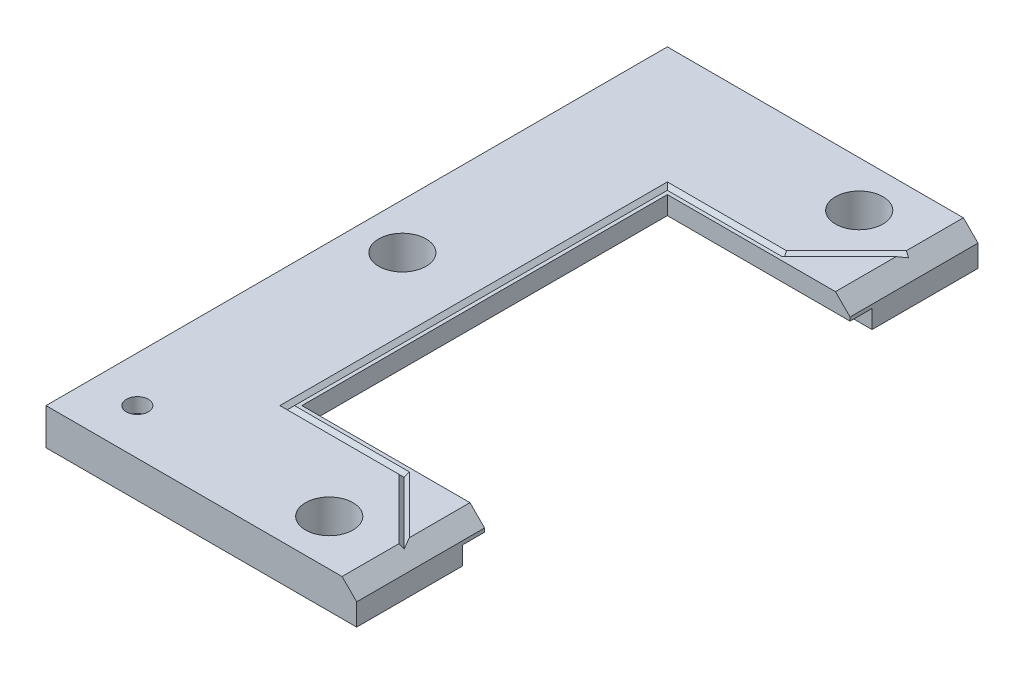
ISO-10303-21;
HEADER;
FILE_DESCRIPTION(('STEP AP214'),'2;1');
FILE_NAME('part.step','',(''),(''),'','','');
FILE_SCHEMA(('AUTOMOTIVE_DESIGN { 1 0 10303 214 1 1 1 1 }'));
ENDSEC;
DATA;
#1=APPLICATION_CONTEXT('core data for automotive mechanical design processes');
#2=APPLICATION_PROTOCOL_DEFINITION('international standard','automotive_design',2000,#1);
#3=PRODUCT_CONTEXT('',#1,'mechanical');
#4=PRODUCT('Part','Part','',(#3));
#5=PRODUCT_RELATED_PRODUCT_CATEGORY('part','',(#4));
#6=PRODUCT_DEFINITION_FORMATION('','',#4);
#7=PRODUCT_DEFINITION_CONTEXT('part definition',#1,'design');
#8=PRODUCT_DEFINITION('design','',#6,#7);
#9=PRODUCT_DEFINITION_SHAPE('','',#8);
#10=(LENGTH_UNIT() NAMED_UNIT(*) SI_UNIT(.MILLI.,.METRE.));
#11=(NAMED_UNIT(*) PLANE_ANGLE_UNIT() SI_UNIT($,.RADIAN.));
#12=(NAMED_UNIT(*) SI_UNIT($,.STERADIAN.) SOLID_ANGLE_UNIT());
#13=UNCERTAINTY_MEASURE_WITH_UNIT(LENGTH_MEASURE(1.E-05),#10,'distance_accuracy_value','');
#14=(GEOMETRIC_REPRESENTATION_CONTEXT(3) GLOBAL_UNCERTAINTY_ASSIGNED_CONTEXT((#13)) GLOBAL_UNIT_ASSIGNED_CONTEXT((#10,
#11,#12)) REPRESENTATION_CONTEXT('',''));
#15=CARTESIAN_POINT('',(0.,0.,0.));
#16=DIRECTION('',(0.,0.,1.));
#17=DIRECTION('',(1.,0.,0.));
#18=AXIS2_PLACEMENT_3D('',#15,#16,#17);
#19=CARTESIAN_POINT('',(0.,10.,0.));
#20=DIRECTION('',(0.,-1.,0.));
#21=DIRECTION('',(0.,0.,-1.));
#22=AXIS2_PLACEMENT_3D('',#19,#20,#21);
#23=PLANE('',#22);
#24=CARTESIAN_POINT('',(-19.9999999999997,10.,-72.5000000000001));
#25=DIRECTION('',(0.,1.,0.));
#26=DIRECTION('',(-1.,0.,0.));
#27=AXIS2_PLACEMENT_3D('',#24,#25,#26);
#28=CIRCLE('',#27,6.50000000000002);
#29=CARTESIAN_POINT('',(-26.4999999999997,10.,-72.5000000000001));
#30=VERTEX_POINT('',#29);
#31=EDGE_CURVE('E275',#30,#30,#28,.T.);
#32=ORIENTED_EDGE('',*,*,#31,.F.);
#33=EDGE_LOOP('',(#32));
#34=FACE_BOUND('',#33,.T.);
#35=CARTESIAN_POINT('',(-19.9999999999998,10.,72.4999999999999));
#36=DIRECTION('',(0.,1.,0.));
#37=DIRECTION('',(-1.,0.,0.));
#38=AXIS2_PLACEMENT_3D('',#35,#36,#37);
#39=CIRCLE('',#38,6.50000000000002);
#40=CARTESIAN_POINT('',(-26.4999999999998,10.,72.4999999999999));
#41=VERTEX_POINT('',#40);
#42=EDGE_CURVE('E286',#41,#41,#39,.T.);
#43=ORIENTED_EDGE('',*,*,#42,.F.);
#44=EDGE_LOOP('',(#43));
#45=FACE_BOUND('',#44,.T.);
#46=CARTESIAN_POINT('',(-72.4999600306071,10.,-1.59935215800008E-13));
#47=DIRECTION('',(0.,1.,0.));
#48=DIRECTION('',(-1.,0.,0.));
#49=AXIS2_PLACEMENT_3D('',#46,#47,#48);
#50=CIRCLE('',#49,6.50000000000002);
#51=CARTESIAN_POINT('',(-78.9999600306071,10.,-1.59935215800008E-13));
#52=VERTEX_POINT('',#51);
#53=EDGE_CURVE('E280',#52,#52,#50,.T.);
#54=ORIENTED_EDGE('',*,*,#53,.F.);
#55=EDGE_LOOP('',(#54));
#56=FACE_BOUND('',#55,.T.);
#57=CARTESIAN_POINT('',(-72.4999999999998,10.,72.4999999999999));
#58=DIRECTION('',(0.,1.,0.));
#59=DIRECTION('',(0.,0.,1.));
#60=AXIS2_PLACEMENT_3D('',#57,#58,#59);
#61=CIRCLE('',#60,3.);
#62=CARTESIAN_POINT('',(-72.4999999999998,10.,75.4999999999999));
#63=VERTEX_POINT('',#62);
#64=EDGE_CURVE('E269',#63,#63,#61,.T.);
#65=ORIENTED_EDGE('',*,*,#64,.F.);
#66=EDGE_LOOP('',(#65));
#67=FACE_BOUND('',#66,.T.);
#68=DIRECTION('',(0.707106781186551,0.,-0.707106781186544));
#69=VECTOR('',#68,1.);
#70=CARTESIAN_POINT('',(-21.1000000000002,10.,-52.3142135623732));
#71=LINE('',#70,#69);
#72=CARTESIAN_POINT('',(-20.4142135623734,10.,-53.));
#73=VERTEX_POINT('',#72);
#74=CARTESIAN_POINT('',(-4.,10.,-69.4142135623732));
#75=VERTEX_POINT('',#74);
#76=EDGE_CURVE('E263',#73,#75,#71,.T.);
#77=ORIENTED_EDGE('',*,*,#76,.T.);
#78=DIRECTION('',(0.,0.,-1.));
#79=VECTOR('',#78,1.);
#80=CARTESIAN_POINT('',(-4.,10.,0.));
#81=LINE('',#80,#79);
#82=CARTESIAN_POINT('',(-3.99999999999999,10.,-85.));
#83=VERTEX_POINT('',#82);
#84=EDGE_CURVE('E390',#75,#83,#81,.T.);
#85=ORIENTED_EDGE('',*,*,#84,.T.);
#86=DIRECTION('',(-1.,0.,0.));
#87=VECTOR('',#86,1.);
#88=CARTESIAN_POINT('',(-85.,10.,-85.));
#89=LINE('',#88,#87);
#90=CARTESIAN_POINT('',(-85.,10.,-85.));
#91=VERTEX_POINT('',#90);
#92=EDGE_CURVE('E356',#83,#91,#89,.T.);
#93=ORIENTED_EDGE('',*,*,#92,.T.);
#94=DIRECTION('',(0.,0.,1.));
#95=VECTOR('',#94,1.);
#96=CARTESIAN_POINT('',(-85.,10.,85.));
#97=LINE('',#96,#95);
#98=CARTESIAN_POINT('',(-85.,10.,85.));
#99=VERTEX_POINT('',#98);
#100=EDGE_CURVE('E342',#91,#99,#97,.T.);
#101=ORIENTED_EDGE('',*,*,#100,.T.);
#102=DIRECTION('',(1.,0.,0.));
#103=VECTOR('',#102,1.);
#104=CARTESIAN_POINT('',(-85.,10.,85.));
#105=LINE('',#104,#103);
#106=CARTESIAN_POINT('',(-4.00000000000005,10.,85.));
#107=VERTEX_POINT('',#106);
#108=EDGE_CURVE('E345',#99,#107,#105,.T.);
#109=ORIENTED_EDGE('',*,*,#108,.T.);
#110=DIRECTION('',(0.,0.,-1.));
#111=VECTOR('',#110,1.);
#112=CARTESIAN_POINT('',(-4.00000000000003,10.,0.));
#113=LINE('',#112,#111);
#114=CARTESIAN_POINT('',(-4.00000000000004,10.,69.4142135623731));
#115=VERTEX_POINT('',#114);
#116=EDGE_CURVE('E395',#107,#115,#113,.T.);
#117=ORIENTED_EDGE('',*,*,#116,.T.);
#118=DIRECTION('',(-0.707106781186551,0.,-0.707106781186544));
#119=VECTOR('',#118,1.);
#120=CARTESIAN_POINT('',(-0.707106781186559,10.,72.7071067811866));
#121=LINE('',#120,#119);
#122=CARTESIAN_POINT('',(-20.4142135623733,10.,53.));
#123=VERTEX_POINT('',#122);
#124=EDGE_CURVE('E206',#115,#123,#121,.T.);
#125=ORIENTED_EDGE('',*,*,#124,.T.);
#126=DIRECTION('',(-1.,0.,0.));
#127=VECTOR('',#126,1.);
#128=CARTESIAN_POINT('',(-19.4443650813899,10.,53.));
#129=LINE('',#128,#127);
#130=CARTESIAN_POINT('',(-53.,10.,53.));
#131=VERTEX_POINT('',#130);
#132=EDGE_CURVE('E225',#123,#131,#129,.T.);
#133=ORIENTED_EDGE('',*,*,#132,.T.);
#134=DIRECTION('',(0.,0.,-1.));
#135=VECTOR('',#134,1.);
#136=CARTESIAN_POINT('',(-53.,10.,53.2));
#137=LINE('',#136,#135);
#138=CARTESIAN_POINT('',(-53.,10.,-53.));
#139=VERTEX_POINT('',#138);
#140=EDGE_CURVE('E239',#131,#139,#137,.T.);
#141=ORIENTED_EDGE('',*,*,#140,.T.);
#142=DIRECTION('',(1.,0.,0.));
#143=VECTOR('',#142,1.);
#144=CARTESIAN_POINT('',(-53.2,10.,-53.));
#145=LINE('',#144,#143);
#146=EDGE_CURVE('E252',#139,#73,#145,.T.);
#147=ORIENTED_EDGE('',*,*,#146,.T.);
#148=EDGE_LOOP('',(#77,#85,#93,#101,#109,#117,#125,#133,#141,#147));
#149=FACE_BOUND('',#148,.T.);
#150=ADVANCED_FACE('F37',(#34,#45,#56,#67,#149),#23,.F.);
#151=DIRECTION('',(0.707106781186551,0.,-0.707106781186544));
#152=VECTOR('',#151,1.);
#153=CARTESIAN_POINT('',(-19.6857864376272,10.,-50.9));
#154=LINE('',#153,#152);
#155=CARTESIAN_POINT('',(-19.5857864376272,10.,-51.));
#156=VERTEX_POINT('',#155);
#157=CARTESIAN_POINT('',(-3.99999999999999,10.,-66.585786437627));
#158=VERTEX_POINT('',#157);
#159=EDGE_CURVE('E266',#156,#158,#154,.T.);
#160=ORIENTED_EDGE('',*,*,#159,.F.);
#161=DIRECTION('',(1.,0.,0.));
#162=VECTOR('',#161,1.);
#163=CARTESIAN_POINT('',(-53.2000000000001,10.,-51.));
#164=LINE('',#163,#162);
#165=CARTESIAN_POINT('',(-51.,10.,-51.));
#166=VERTEX_POINT('',#165);
#167=EDGE_CURVE('E255',#166,#156,#164,.T.);
#168=ORIENTED_EDGE('',*,*,#167,.F.);
#169=DIRECTION('',(0.,0.,-1.));
#170=VECTOR('',#169,1.);
#171=CARTESIAN_POINT('',(-51.,10.,53.2));
#172=LINE('',#171,#170);
#173=CARTESIAN_POINT('',(-51.,10.,51.));
#174=VERTEX_POINT('',#173);
#175=EDGE_CURVE('E224',#174,#166,#172,.T.);
#176=ORIENTED_EDGE('',*,*,#175,.F.);
#177=DIRECTION('',(-1.,0.,0.));
#178=VECTOR('',#177,1.);
#179=CARTESIAN_POINT('',(-19.4443650813899,10.,51.));
#180=LINE('',#179,#178);
#181=CARTESIAN_POINT('',(-19.5857864376272,10.,51.));
#182=VERTEX_POINT('',#181);
#183=EDGE_CURVE('E214',#182,#174,#180,.T.);
#184=ORIENTED_EDGE('',*,*,#183,.F.);
#185=DIRECTION('',(-0.707106781186551,0.,-0.707106781186544));
#186=VECTOR('',#185,1.);
#187=CARTESIAN_POINT('',(0.707106781186538,10.,71.2928932188135));
#188=LINE('',#187,#186);
#189=CARTESIAN_POINT('',(-4.00000000000006,10.,66.5857864376269));
#190=VERTEX_POINT('',#189);
#191=EDGE_CURVE('E197',#190,#182,#188,.T.);
#192=ORIENTED_EDGE('',*,*,#191,.F.);
#193=CARTESIAN_POINT('',(-4.00000000000005,10.,50.));
#194=VERTEX_POINT('',#193);
#195=EDGE_CURVE('E394',#190,#194,#113,.T.);
#196=ORIENTED_EDGE('',*,*,#195,.T.);
#197=DIRECTION('',(-1.,0.,0.));
#198=VECTOR('',#197,1.);
#199=CARTESIAN_POINT('',(-50.,10.,50.));
#200=LINE('',#199,#198);
#201=CARTESIAN_POINT('',(-50.,10.,50.));
#202=VERTEX_POINT('',#201);
#203=EDGE_CURVE('E349',#194,#202,#200,.T.);
#204=ORIENTED_EDGE('',*,*,#203,.T.);
#205=DIRECTION('',(0.,0.,-1.));
#206=VECTOR('',#205,1.);
#207=CARTESIAN_POINT('',(-50.,10.,50.));
#208=LINE('',#207,#206);
#209=CARTESIAN_POINT('',(-50.,10.,-50.));
#210=VERTEX_POINT('',#209);
#211=EDGE_CURVE('E351',#202,#210,#208,.T.);
#212=ORIENTED_EDGE('',*,*,#211,.T.);
#213=DIRECTION('',(1.,0.,0.));
#214=VECTOR('',#213,1.);
#215=CARTESIAN_POINT('',(-50.,10.,-50.));
#216=LINE('',#215,#214);
#217=CARTESIAN_POINT('',(-4.,10.,-50.));
#218=VERTEX_POINT('',#217);
#219=EDGE_CURVE('E353',#210,#218,#216,.T.);
#220=ORIENTED_EDGE('',*,*,#219,.T.);
#221=EDGE_CURVE('E391',#218,#158,#81,.T.);
#222=ORIENTED_EDGE('',*,*,#221,.T.);
#223=EDGE_LOOP('',(#160,#168,#176,#184,#192,#196,#204,#212,#220,#222));
#224=FACE_BOUND('',#223,.T.);
#225=ADVANCED_FACE('F221',(#224),#23,.F.);
#226=CARTESIAN_POINT('',(-4.00000000000003,10.,0.));
#227=DIRECTION('',(-0.707106781186547,-0.707106781186547,0.));
#228=DIRECTION('',(0.,0.,-1.));
#229=AXIS2_PLACEMENT_3D('',#226,#227,#228);
#230=PLANE('',#229);
#231=DIRECTION('',(-0.357406744336594,0.357406744336594,-0.862856209461016));
#232=VECTOR('',#231,1.);
#233=CARTESIAN_POINT('',(-24.5344325389259,30.5344325389258,17.011280906517));
#234=LINE('',#233,#232);
#235=CARTESIAN_POINT('',(-3.00000000000008,9.00000000000002,69.));
#236=VERTEX_POINT('',#235);
#237=EDGE_CURVE('E46',#190,#236,#234,.F.);
#238=ORIENTED_EDGE('',*,*,#237,.T.);
#239=DIRECTION('',(0.678598344545844,-0.678598344545844,-0.281084637714833));
#240=VECTOR('',#239,1.);
#241=CARTESIAN_POINT('',(9.24031489186749,-3.24031489186753,63.9298955640709));
#242=LINE('',#241,#240);
#243=EDGE_CURVE('E11',#236,#115,#242,.F.);
#244=ORIENTED_EDGE('',*,*,#243,.T.);
#245=ORIENTED_EDGE('',*,*,#116,.F.);
#246=DIRECTION('',(0.707106781186548,-0.707106781186548,0.));
#247=VECTOR('',#246,1.);
#248=CARTESIAN_POINT('',(-4.00000000000004,10.,85.));
#249=LINE('',#248,#247);
#250=CARTESIAN_POINT('',(0.,5.99999999999997,85.));
#251=VERTEX_POINT('',#250);
#252=EDGE_CURVE('E402',#251,#107,#249,.F.);
#253=ORIENTED_EDGE('',*,*,#252,.F.);
#254=DIRECTION('',(0.,0.,1.));
#255=VECTOR('',#254,1.);
#256=CARTESIAN_POINT('',(0.,5.99999999999997,85.));
#257=LINE('',#256,#255);
#258=CARTESIAN_POINT('',(0.,5.99999999999997,50.));
#259=VERTEX_POINT('',#258);
#260=EDGE_CURVE('E400',#259,#251,#257,.T.);
#261=ORIENTED_EDGE('',*,*,#260,.F.);
#262=DIRECTION('',(-0.707106781186548,0.707106781186548,0.));
#263=VECTOR('',#262,1.);
#264=CARTESIAN_POINT('',(-4.00000000000003,9.99999999999999,50.));
#265=LINE('',#264,#263);
#266=EDGE_CURVE('E398',#194,#259,#265,.F.);
#267=ORIENTED_EDGE('',*,*,#266,.F.);
#268=ORIENTED_EDGE('',*,*,#195,.F.);
#269=EDGE_LOOP('',(#238,#244,#245,#253,#261,#267,#268));
#270=FACE_BOUND('',#269,.T.);
#271=ADVANCED_FACE('F415',(#270),#230,.F.);
#272=CARTESIAN_POINT('',(-4.,10.,0.));
#273=DIRECTION('',(-0.707106781186547,-0.707106781186547,0.));
#274=DIRECTION('',(0.,0.,-1.));
#275=AXIS2_PLACEMENT_3D('',#272,#273,#274);
#276=PLANE('',#275);
#277=DIRECTION('',(-0.678598344545844,0.678598344545844,-0.281084637714833));
#278=VECTOR('',#277,1.);
#279=CARTESIAN_POINT('',(9.24031489186754,-3.24031489186753,-63.9298955640709));
#280=LINE('',#279,#278);
#281=CARTESIAN_POINT('',(-3.00000000000001,9.00000000000001,-69.0000000000001));
#282=VERTEX_POINT('',#281);
#283=EDGE_CURVE('E409',#75,#282,#280,.F.);
#284=ORIENTED_EDGE('',*,*,#283,.T.);
#285=DIRECTION('',(0.357406744336594,-0.357406744336594,-0.862856209461016));
#286=VECTOR('',#285,1.);
#287=CARTESIAN_POINT('',(-24.5344325389259,30.5344325389258,-17.011280906517));
#288=LINE('',#287,#286);
#289=EDGE_CURVE('E412',#282,#158,#288,.F.);
#290=ORIENTED_EDGE('',*,*,#289,.T.);
#291=ORIENTED_EDGE('',*,*,#221,.F.);
#292=DIRECTION('',(0.707106781186548,-0.707106781186548,0.));
#293=VECTOR('',#292,1.);
#294=CARTESIAN_POINT('',(-4.,10.,-50.));
#295=LINE('',#294,#293);
#296=CARTESIAN_POINT('',(0.,6.,-50.));
#297=VERTEX_POINT('',#296);
#298=EDGE_CURVE('E407',#297,#218,#295,.F.);
#299=ORIENTED_EDGE('',*,*,#298,.F.);
#300=DIRECTION('',(0.,0.,1.));
#301=VECTOR('',#300,1.);
#302=CARTESIAN_POINT('',(0.,6.,-50.));
#303=LINE('',#302,#301);
#304=CARTESIAN_POINT('',(0.,6.,-85.));
#305=VERTEX_POINT('',#304);
#306=EDGE_CURVE('E61',#305,#297,#303,.T.);
#307=ORIENTED_EDGE('',*,*,#306,.F.);
#308=DIRECTION('',(-0.707106781186548,0.707106781186548,0.));
#309=VECTOR('',#308,1.);
#310=CARTESIAN_POINT('',(-4.,10.,-85.));
#311=LINE('',#310,#309);
#312=EDGE_CURVE('E404',#83,#305,#311,.F.);
#313=ORIENTED_EDGE('',*,*,#312,.F.);
#314=ORIENTED_EDGE('',*,*,#84,.F.);
#315=EDGE_LOOP('',(#284,#290,#291,#299,#307,#313,#314));
#316=FACE_BOUND('',#315,.T.);
#317=ADVANCED_FACE('F40',(#316),#276,.F.);
#318=CARTESIAN_POINT('',(0.,10.,85.));
#319=DIRECTION('',(-1.,0.,0.));
#320=DIRECTION('',(0.,0.,1.));
#321=AXIS2_PLACEMENT_3D('',#318,#319,#320);
#322=PLANE('',#321);
#323=DIRECTION('',(0.,-1.,0.));
#324=VECTOR('',#323,1.);
#325=CARTESIAN_POINT('',(0.,10.,50.));
#326=LINE('',#325,#324);
#327=CARTESIAN_POINT('',(0.,5.,50.));
#328=VERTEX_POINT('',#327);
#329=EDGE_CURVE('E383',#259,#328,#326,.T.);
#330=ORIENTED_EDGE('',*,*,#329,.F.);
#331=ORIENTED_EDGE('',*,*,#260,.T.);
#332=DIRECTION('',(0.,-1.,0.));
#333=VECTOR('',#332,1.);
#334=CARTESIAN_POINT('',(0.,10.,85.));
#335=LINE('',#334,#333);
#336=CARTESIAN_POINT('',(0.,0.,85.));
#337=VERTEX_POINT('',#336);
#338=EDGE_CURVE('E385',#251,#337,#335,.T.);
#339=ORIENTED_EDGE('',*,*,#338,.T.);
#340=DIRECTION('',(0.,0.,-1.));
#341=VECTOR('',#340,1.);
#342=CARTESIAN_POINT('',(0.,0.,85.));
#343=LINE('',#342,#341);
#344=CARTESIAN_POINT('',(0.,0.,56.));
#345=VERTEX_POINT('',#344);
#346=EDGE_CURVE('E364',#337,#345,#343,.T.);
#347=ORIENTED_EDGE('',*,*,#346,.T.);
#348=DIRECTION('',(0.,1.,0.));
#349=VECTOR('',#348,1.);
#350=CARTESIAN_POINT('',(0.,0.,56.));
#351=LINE('',#350,#349);
#352=CARTESIAN_POINT('',(0.,5.,56.));
#353=VERTEX_POINT('',#352);
#354=EDGE_CURVE('E331',#345,#353,#351,.T.);
#355=ORIENTED_EDGE('',*,*,#354,.T.);
#356=DIRECTION('',(0.,0.,-1.));
#357=VECTOR('',#356,1.);
#358=CARTESIAN_POINT('',(0.,5.,50.));
#359=LINE('',#358,#357);
#360=EDGE_CURVE('E335',#353,#328,#359,.T.);
#361=ORIENTED_EDGE('',*,*,#360,.T.);
#362=EDGE_LOOP('',(#330,#331,#339,#347,#355,#361));
#363=FACE_BOUND('',#362,.T.);
#364=ADVANCED_FACE('F498',(#363),#322,.F.);
#365=CARTESIAN_POINT('',(-50.,10.,50.));
#366=DIRECTION('',(0.,0.,1.));
#367=DIRECTION('',(1.,0.,0.));
#368=AXIS2_PLACEMENT_3D('',#365,#366,#367);
#369=PLANE('',#368);
#370=ORIENTED_EDGE('',*,*,#203,.F.);
#371=ORIENTED_EDGE('',*,*,#266,.T.);
#372=ORIENTED_EDGE('',*,*,#329,.T.);
#373=DIRECTION('',(-1.,0.,0.));
#374=VECTOR('',#373,1.);
#375=CARTESIAN_POINT('',(0.999999999999993,5.,50.));
#376=LINE('',#375,#374);
#377=CARTESIAN_POINT('',(-50.,5.,50.));
#378=VERTEX_POINT('',#377);
#379=EDGE_CURVE('E301',#328,#378,#376,.T.);
#380=ORIENTED_EDGE('',*,*,#379,.T.);
#381=DIRECTION('',(0.,-1.,0.));
#382=VECTOR('',#381,1.);
#383=CARTESIAN_POINT('',(-50.,10.,50.));
#384=LINE('',#383,#382);
#385=EDGE_CURVE('E380',#202,#378,#384,.T.);
#386=ORIENTED_EDGE('',*,*,#385,.F.);
#387=EDGE_LOOP('',(#370,#371,#372,#380,#386));
#388=FACE_BOUND('',#387,.T.);
#389=ADVANCED_FACE('F424',(#388),#369,.F.);
#390=CARTESIAN_POINT('',(-50.,10.,50.));
#391=DIRECTION('',(-1.,0.,0.));
#392=DIRECTION('',(0.,0.,1.));
#393=AXIS2_PLACEMENT_3D('',#390,#391,#392);
#394=PLANE('',#393);
#395=DIRECTION('',(0.,0.,-1.));
#396=VECTOR('',#395,1.);
#397=CARTESIAN_POINT('',(-50.,5.,56.7));
#398=LINE('',#397,#396);
#399=CARTESIAN_POINT('',(-50.,5.,-50.));
#400=VERTEX_POINT('',#399);
#401=EDGE_CURVE('E312',#378,#400,#398,.T.);
#402=ORIENTED_EDGE('',*,*,#401,.T.);
#403=DIRECTION('',(0.,-1.,0.));
#404=VECTOR('',#403,1.);
#405=CARTESIAN_POINT('',(-50.,10.,-50.));
#406=LINE('',#405,#404);
#407=EDGE_CURVE('E377',#210,#400,#406,.T.);
#408=ORIENTED_EDGE('',*,*,#407,.F.);
#409=ORIENTED_EDGE('',*,*,#211,.F.);
#410=ORIENTED_EDGE('',*,*,#385,.T.);
#411=EDGE_LOOP('',(#402,#408,#409,#410));
#412=FACE_BOUND('',#411,.T.);
#413=ADVANCED_FACE('F427',(#412),#394,.F.);
#414=CARTESIAN_POINT('',(-50.,10.,-50.));
#415=DIRECTION('',(0.,0.,-1.));
#416=DIRECTION('',(-1.,0.,0.));
#417=AXIS2_PLACEMENT_3D('',#414,#415,#416);
#418=PLANE('',#417);
#419=DIRECTION('',(0.,-1.,0.));
#420=VECTOR('',#419,1.);
#421=CARTESIAN_POINT('',(0.,10.,-50.));
#422=LINE('',#421,#420);
#423=CARTESIAN_POINT('',(0.,5.,-50.));
#424=VERTEX_POINT('',#423);
#425=EDGE_CURVE('E375',#297,#424,#422,.T.);
#426=ORIENTED_EDGE('',*,*,#425,.F.);
#427=ORIENTED_EDGE('',*,*,#298,.T.);
#428=ORIENTED_EDGE('',*,*,#219,.F.);
#429=ORIENTED_EDGE('',*,*,#407,.T.);
#430=DIRECTION('',(1.,0.,0.));
#431=VECTOR('',#430,1.);
#432=CARTESIAN_POINT('',(-56.7,5.,-50.));
#433=LINE('',#432,#431);
#434=EDGE_CURVE('E302',#400,#424,#433,.T.);
#435=ORIENTED_EDGE('',*,*,#434,.T.);
#436=EDGE_LOOP('',(#426,#427,#428,#429,#435));
#437=FACE_BOUND('',#436,.T.);
#438=ADVANCED_FACE('F430',(#437),#418,.F.);
#439=CARTESIAN_POINT('',(0.,10.,-50.));
#440=DIRECTION('',(-1.,0.,0.));
#441=DIRECTION('',(0.,0.,1.));
#442=AXIS2_PLACEMENT_3D('',#439,#440,#441);
#443=PLANE('',#442);
#444=DIRECTION('',(0.,-1.,0.));
#445=VECTOR('',#444,1.);
#446=CARTESIAN_POINT('',(0.,10.,-85.));
#447=LINE('',#446,#445);
#448=CARTESIAN_POINT('',(0.,0.,-85.));
#449=VERTEX_POINT('',#448);
#450=EDGE_CURVE('E373',#305,#449,#447,.T.);
#451=ORIENTED_EDGE('',*,*,#450,.F.);
#452=ORIENTED_EDGE('',*,*,#306,.T.);
#453=ORIENTED_EDGE('',*,*,#425,.T.);
#454=DIRECTION('',(0.,0.,-1.));
#455=VECTOR('',#454,1.);
#456=CARTESIAN_POINT('',(0.,5.,-50.));
#457=LINE('',#456,#455);
#458=CARTESIAN_POINT('',(0.,5.,-56.));
#459=VERTEX_POINT('',#458);
#460=EDGE_CURVE('E298',#424,#459,#457,.T.);
#461=ORIENTED_EDGE('',*,*,#460,.T.);
#462=DIRECTION('',(0.,-1.,0.));
#463=VECTOR('',#462,1.);
#464=CARTESIAN_POINT('',(0.,0.,-56.));
#465=LINE('',#464,#463);
#466=CARTESIAN_POINT('',(0.,0.,-56.));
#467=VERTEX_POINT('',#466);
#468=EDGE_CURVE('E294',#459,#467,#465,.T.);
#469=ORIENTED_EDGE('',*,*,#468,.T.);
#470=DIRECTION('',(0.,0.,-1.));
#471=VECTOR('',#470,1.);
#472=CARTESIAN_POINT('',(0.,0.,-50.));
#473=LINE('',#472,#471);
#474=EDGE_CURVE('E367',#467,#449,#473,.T.);
#475=ORIENTED_EDGE('',*,*,#474,.T.);
#476=EDGE_LOOP('',(#451,#452,#453,#461,#469,#475));
#477=FACE_BOUND('',#476,.T.);
#478=ADVANCED_FACE('F481',(#477),#443,.F.);
#479=CARTESIAN_POINT('',(0.,0.,0.));
#480=DIRECTION('',(0.,-1.,0.));
#481=DIRECTION('',(0.,0.,-1.));
#482=AXIS2_PLACEMENT_3D('',#479,#480,#481);
#483=PLANE('',#482);
#484=CARTESIAN_POINT('',(-72.4999600306071,0.,-1.59935215800008E-13));
#485=DIRECTION('',(0.,1.,0.));
#486=DIRECTION('',(-1.,0.,0.));
#487=AXIS2_PLACEMENT_3D('',#484,#485,#486);
#488=CIRCLE('',#487,6.50000000000002);
#489=CARTESIAN_POINT('',(-78.9999600306071,0.,-1.59935215800008E-13));
#490=VERTEX_POINT('',#489);
#491=EDGE_CURVE('E276',#490,#490,#488,.T.);
#492=ORIENTED_EDGE('',*,*,#491,.T.);
#493=EDGE_LOOP('',(#492));
#494=FACE_BOUND('',#493,.T.);
#495=CARTESIAN_POINT('',(-19.9999999999998,0.,72.4999999999999));
#496=DIRECTION('',(0.,1.,0.));
#497=DIRECTION('',(-1.,0.,0.));
#498=AXIS2_PLACEMENT_3D('',#495,#496,#497);
#499=CIRCLE('',#498,6.50000000000002);
#500=CARTESIAN_POINT('',(-26.4999999999998,0.,72.4999999999999));
#501=VERTEX_POINT('',#500);
#502=EDGE_CURVE('E283',#501,#501,#499,.T.);
#503=ORIENTED_EDGE('',*,*,#502,.T.);
#504=EDGE_LOOP('',(#503));
#505=FACE_BOUND('',#504,.T.);
#506=CARTESIAN_POINT('',(-19.9999999999997,0.,-72.5000000000001));
#507=DIRECTION('',(0.,1.,0.));
#508=DIRECTION('',(-1.,0.,0.));
#509=AXIS2_PLACEMENT_3D('',#506,#507,#508);
#510=CIRCLE('',#509,6.50000000000002);
#511=CARTESIAN_POINT('',(-26.4999999999997,0.,-72.5000000000001));
#512=VERTEX_POINT('',#511);
#513=EDGE_CURVE('E289',#512,#512,#510,.T.);
#514=ORIENTED_EDGE('',*,*,#513,.T.);
#515=EDGE_LOOP('',(#514));
#516=FACE_BOUND('',#515,.T.);
#517=ORIENTED_EDGE('',*,*,#474,.F.);
#518=DIRECTION('',(1.,0.,0.));
#519=VECTOR('',#518,1.);
#520=CARTESIAN_POINT('',(-56.7,0.,-56.));
#521=LINE('',#520,#519);
#522=CARTESIAN_POINT('',(-56.,0.,-56.));
#523=VERTEX_POINT('',#522);
#524=EDGE_CURVE('E309',#523,#467,#521,.T.);
#525=ORIENTED_EDGE('',*,*,#524,.F.);
#526=DIRECTION('',(0.,0.,-1.));
#527=VECTOR('',#526,1.);
#528=CARTESIAN_POINT('',(-56.,0.,56.7));
#529=LINE('',#528,#527);
#530=CARTESIAN_POINT('',(-56.,0.,56.));
#531=VERTEX_POINT('',#530);
#532=EDGE_CURVE('E311',#531,#523,#529,.T.);
#533=ORIENTED_EDGE('',*,*,#532,.F.);
#534=DIRECTION('',(-1.,0.,0.));
#535=VECTOR('',#534,1.);
#536=CARTESIAN_POINT('',(0.999999999999992,0.,56.));
#537=LINE('',#536,#535);
#538=EDGE_CURVE('E315',#345,#531,#537,.T.);
#539=ORIENTED_EDGE('',*,*,#538,.F.);
#540=ORIENTED_EDGE('',*,*,#346,.F.);
#541=DIRECTION('',(1.,0.,0.));
#542=VECTOR('',#541,1.);
#543=CARTESIAN_POINT('',(-85.,0.,85.));
#544=LINE('',#543,#542);
#545=CARTESIAN_POINT('',(-85.,0.,85.));
#546=VERTEX_POINT('',#545);
#547=EDGE_CURVE('E361',#546,#337,#544,.T.);
#548=ORIENTED_EDGE('',*,*,#547,.F.);
#549=DIRECTION('',(0.,0.,1.));
#550=VECTOR('',#549,1.);
#551=CARTESIAN_POINT('',(-85.,0.,85.));
#552=LINE('',#551,#550);
#553=CARTESIAN_POINT('',(-85.,0.,-85.));
#554=VERTEX_POINT('',#553);
#555=EDGE_CURVE('E297',#554,#546,#552,.T.);
#556=ORIENTED_EDGE('',*,*,#555,.F.);
#557=DIRECTION('',(-1.,0.,0.));
#558=VECTOR('',#557,1.);
#559=CARTESIAN_POINT('',(-85.,0.,-85.));
#560=LINE('',#559,#558);
#561=EDGE_CURVE('E346',#449,#554,#560,.T.);
#562=ORIENTED_EDGE('',*,*,#561,.F.);
#563=EDGE_LOOP('',(#517,#525,#533,#539,#540,#548,#556,#562));
#564=FACE_BOUND('',#563,.T.);
#565=ADVANCED_FACE('F477',(#494,#505,#516,#564),#483,.T.);
#566=CARTESIAN_POINT('',(-85.,10.,85.));
#567=DIRECTION('',(1.,0.,0.));
#568=DIRECTION('',(0.,0.,-1.));
#569=AXIS2_PLACEMENT_3D('',#566,#567,#568);
#570=PLANE('',#569);
#571=ORIENTED_EDGE('',*,*,#555,.T.);
#572=DIRECTION('',(0.,-1.,0.));
#573=VECTOR('',#572,1.);
#574=CARTESIAN_POINT('',(-85.,10.,85.));
#575=LINE('',#574,#573);
#576=EDGE_CURVE('E387',#99,#546,#575,.T.);
#577=ORIENTED_EDGE('',*,*,#576,.F.);
#578=ORIENTED_EDGE('',*,*,#100,.F.);
#579=DIRECTION('',(0.,-1.,0.));
#580=VECTOR('',#579,1.);
#581=CARTESIAN_POINT('',(-85.,10.,-85.));
#582=LINE('',#581,#580);
#583=EDGE_CURVE('E358',#91,#554,#582,.T.);
#584=ORIENTED_EDGE('',*,*,#583,.T.);
#585=EDGE_LOOP('',(#571,#577,#578,#584));
#586=FACE_BOUND('',#585,.T.);
#587=ADVANCED_FACE('F480',(#586),#570,.F.);
#588=CARTESIAN_POINT('',(-85.,10.,85.));
#589=DIRECTION('',(0.,0.,-1.));
#590=DIRECTION('',(-1.,0.,0.));
#591=AXIS2_PLACEMENT_3D('',#588,#589,#590);
#592=PLANE('',#591);
#593=ORIENTED_EDGE('',*,*,#338,.F.);
#594=ORIENTED_EDGE('',*,*,#252,.T.);
#595=ORIENTED_EDGE('',*,*,#108,.F.);
#596=ORIENTED_EDGE('',*,*,#576,.T.);
#597=ORIENTED_EDGE('',*,*,#547,.T.);
#598=EDGE_LOOP('',(#593,#594,#595,#596,#597));
#599=FACE_BOUND('',#598,.T.);
#600=ADVANCED_FACE('F487',(#599),#592,.F.);
#601=CARTESIAN_POINT('',(-85.,10.,-85.));
#602=DIRECTION('',(0.,0.,1.));
#603=DIRECTION('',(1.,0.,0.));
#604=AXIS2_PLACEMENT_3D('',#601,#602,#603);
#605=PLANE('',#604);
#606=ORIENTED_EDGE('',*,*,#92,.F.);
#607=ORIENTED_EDGE('',*,*,#312,.T.);
#608=ORIENTED_EDGE('',*,*,#450,.T.);
#609=ORIENTED_EDGE('',*,*,#561,.T.);
#610=ORIENTED_EDGE('',*,*,#583,.F.);
#611=EDGE_LOOP('',(#606,#607,#608,#609,#610));
#612=FACE_BOUND('',#611,.T.);
#613=ADVANCED_FACE('F483',(#612),#605,.F.);
#614=CARTESIAN_POINT('',(-56.7,5.,-50.));
#615=DIRECTION('',(0.,-1.,0.));
#616=DIRECTION('',(0.,0.,-1.));
#617=AXIS2_PLACEMENT_3D('',#614,#615,#616);
#618=PLANE('',#617);
#619=ORIENTED_EDGE('',*,*,#434,.F.);
#620=DIRECTION('',(0.707106781186548,0.,0.707106781186548));
#621=VECTOR('',#620,1.);
#622=CARTESIAN_POINT('',(3.35000000000001,5.00000000000001,3.34999999999997));
#623=LINE('',#622,#621);
#624=CARTESIAN_POINT('',(-56.,5.,-56.));
#625=VERTEX_POINT('',#624);
#626=EDGE_CURVE('E279',#625,#400,#623,.T.);
#627=ORIENTED_EDGE('',*,*,#626,.F.);
#628=DIRECTION('',(1.,0.,0.));
#629=VECTOR('',#628,1.);
#630=CARTESIAN_POINT('',(-56.7,5.,-56.));
#631=LINE('',#630,#629);
#632=EDGE_CURVE('E306',#625,#459,#631,.T.);
#633=ORIENTED_EDGE('',*,*,#632,.T.);
#634=ORIENTED_EDGE('',*,*,#460,.F.);
#635=EDGE_LOOP('',(#619,#627,#633,#634));
#636=FACE_BOUND('',#635,.T.);
#637=ADVANCED_FACE('F486',(#636),#618,.T.);
#638=CARTESIAN_POINT('',(-56.7,0.,-56.));
#639=DIRECTION('',(0.,0.,1.));
#640=DIRECTION('',(1.,0.,0.));
#641=AXIS2_PLACEMENT_3D('',#638,#639,#640);
#642=PLANE('',#641);
#643=ORIENTED_EDGE('',*,*,#632,.F.);
#644=DIRECTION('',(0.,1.,0.));
#645=VECTOR('',#644,1.);
#646=CARTESIAN_POINT('',(-56.,0.,-56.));
#647=LINE('',#646,#645);
#648=EDGE_CURVE('E305',#523,#625,#647,.T.);
#649=ORIENTED_EDGE('',*,*,#648,.F.);
#650=ORIENTED_EDGE('',*,*,#524,.T.);
#651=ORIENTED_EDGE('',*,*,#468,.F.);
#652=EDGE_LOOP('',(#643,#649,#650,#651));
#653=FACE_BOUND('',#652,.T.);
#654=ADVANCED_FACE('F617',(#653),#642,.T.);
#655=CARTESIAN_POINT('',(-56.,0.,56.7));
#656=DIRECTION('',(1.,0.,0.));
#657=DIRECTION('',(0.,0.,-1.));
#658=AXIS2_PLACEMENT_3D('',#655,#656,#657);
#659=PLANE('',#658);
#660=ORIENTED_EDGE('',*,*,#532,.T.);
#661=ORIENTED_EDGE('',*,*,#648,.T.);
#662=DIRECTION('',(0.,0.,-1.));
#663=VECTOR('',#662,1.);
#664=CARTESIAN_POINT('',(-56.,5.,56.7));
#665=LINE('',#664,#663);
#666=CARTESIAN_POINT('',(-56.,5.,56.));
#667=VERTEX_POINT('',#666);
#668=EDGE_CURVE('E317',#667,#625,#665,.T.);
#669=ORIENTED_EDGE('',*,*,#668,.F.);
#670=DIRECTION('',(0.,1.,0.));
#671=VECTOR('',#670,1.);
#672=CARTESIAN_POINT('',(-56.,0.,56.));
#673=LINE('',#672,#671);
#674=EDGE_CURVE('E320',#531,#667,#673,.T.);
#675=ORIENTED_EDGE('',*,*,#674,.F.);
#676=EDGE_LOOP('',(#660,#661,#669,#675));
#677=FACE_BOUND('',#676,.T.);
#678=ADVANCED_FACE('F620',(#677),#659,.T.);
#679=CARTESIAN_POINT('',(-50.,5.,56.7));
#680=DIRECTION('',(0.,-1.,0.));
#681=DIRECTION('',(1.,0.,0.));
#682=AXIS2_PLACEMENT_3D('',#679,#680,#681);
#683=PLANE('',#682);
#684=ORIENTED_EDGE('',*,*,#668,.T.);
#685=ORIENTED_EDGE('',*,*,#626,.T.);
#686=ORIENTED_EDGE('',*,*,#401,.F.);
#687=DIRECTION('',(0.707106781186548,0.,-0.707106781186548));
#688=VECTOR('',#687,1.);
#689=CARTESIAN_POINT('',(-24.5,5.,24.5));
#690=LINE('',#689,#688);
#691=EDGE_CURVE('E316',#667,#378,#690,.T.);
#692=ORIENTED_EDGE('',*,*,#691,.F.);
#693=EDGE_LOOP('',(#684,#685,#686,#692));
#694=FACE_BOUND('',#693,.T.);
#695=ADVANCED_FACE('F627',(#694),#683,.T.);
#696=CARTESIAN_POINT('',(0.999999999999992,0.,56.));
#697=DIRECTION('',(0.,0.,-1.));
#698=DIRECTION('',(-1.,0.,0.));
#699=AXIS2_PLACEMENT_3D('',#696,#697,#698);
#700=PLANE('',#699);
#701=ORIENTED_EDGE('',*,*,#538,.T.);
#702=ORIENTED_EDGE('',*,*,#674,.T.);
#703=DIRECTION('',(-1.,0.,0.));
#704=VECTOR('',#703,1.);
#705=CARTESIAN_POINT('',(0.999999999999992,5.,56.));
#706=LINE('',#705,#704);
#707=EDGE_CURVE('E334',#353,#667,#706,.T.);
#708=ORIENTED_EDGE('',*,*,#707,.F.);
#709=ORIENTED_EDGE('',*,*,#354,.F.);
#710=EDGE_LOOP('',(#701,#702,#708,#709));
#711=FACE_BOUND('',#710,.T.);
#712=ADVANCED_FACE('F475',(#711),#700,.T.);
#713=CARTESIAN_POINT('',(0.999999999999993,5.,50.));
#714=DIRECTION('',(0.,-1.,0.));
#715=DIRECTION('',(0.,0.,-1.));
#716=AXIS2_PLACEMENT_3D('',#713,#714,#715);
#717=PLANE('',#716);
#718=ORIENTED_EDGE('',*,*,#707,.T.);
#719=ORIENTED_EDGE('',*,*,#691,.T.);
#720=ORIENTED_EDGE('',*,*,#379,.F.);
#721=ORIENTED_EDGE('',*,*,#360,.F.);
#722=EDGE_LOOP('',(#718,#719,#720,#721));
#723=FACE_BOUND('',#722,.T.);
#724=ADVANCED_FACE('F489',(#723),#717,.T.);
#725=CARTESIAN_POINT('',(-19.9999999999997,0.,-72.5000000000001));
#726=DIRECTION('',(0.,1.,0.));
#727=DIRECTION('',(-1.,0.,0.));
#728=AXIS2_PLACEMENT_3D('',#725,#726,#727);
#729=CYLINDRICAL_SURFACE('',#728,6.50000000000002);
#730=ORIENTED_EDGE('',*,*,#513,.F.);
#731=EDGE_LOOP('',(#730));
#732=FACE_BOUND('',#731,.T.);
#733=ORIENTED_EDGE('',*,*,#31,.T.);
#734=EDGE_LOOP('',(#733));
#735=FACE_BOUND('',#734,.T.);
#736=ADVANCED_FACE('F612',(#732,#735),#729,.F.);
#737=CARTESIAN_POINT('',(-19.9999999999998,0.,72.4999999999999));
#738=DIRECTION('',(0.,1.,0.));
#739=DIRECTION('',(-1.,0.,0.));
#740=AXIS2_PLACEMENT_3D('',#737,#738,#739);
#741=CYLINDRICAL_SURFACE('',#740,6.50000000000002);
#742=ORIENTED_EDGE('',*,*,#502,.F.);
#743=EDGE_LOOP('',(#742));
#744=FACE_BOUND('',#743,.T.);
#745=ORIENTED_EDGE('',*,*,#42,.T.);
#746=EDGE_LOOP('',(#745));
#747=FACE_BOUND('',#746,.T.);
#748=ADVANCED_FACE('F608',(#744,#747),#741,.F.);
#749=CARTESIAN_POINT('',(-72.4999600306071,0.,-1.59935215800008E-13));
#750=DIRECTION('',(0.,1.,0.));
#751=DIRECTION('',(-1.,0.,0.));
#752=AXIS2_PLACEMENT_3D('',#749,#750,#751);
#753=CYLINDRICAL_SURFACE('',#752,6.50000000000002);
#754=ORIENTED_EDGE('',*,*,#491,.F.);
#755=EDGE_LOOP('',(#754));
#756=FACE_BOUND('',#755,.T.);
#757=ORIENTED_EDGE('',*,*,#53,.T.);
#758=EDGE_LOOP('',(#757));
#759=FACE_BOUND('',#758,.T.);
#760=ADVANCED_FACE('F604',(#756,#759),#753,.F.);
#761=CARTESIAN_POINT('',(-72.4999999999998,6.,72.4999999999999));
#762=DIRECTION('',(0.,1.,0.));
#763=DIRECTION('',(0.,0.,1.));
#764=AXIS2_PLACEMENT_3D('',#761,#762,#763);
#765=CONICAL_SURFACE('',#764,3.,1.02974425867665);
#766=CARTESIAN_POINT('',(-72.4999999999998,4.19741814291732,72.4999999999999));
#767=VERTEX_POINT('',#766);
#768=VERTEX_LOOP('',#767);
#769=FACE_BOUND('',#768,.T.);
#770=CARTESIAN_POINT('',(-72.4999999999998,6.,72.4999999999999));
#771=DIRECTION('',(0.,1.,0.));
#772=DIRECTION('',(0.,0.,1.));
#773=AXIS2_PLACEMENT_3D('',#770,#771,#772);
#774=CIRCLE('',#773,3.);
#775=CARTESIAN_POINT('',(-72.4999999999998,6.,75.4999999999999));
#776=VERTEX_POINT('',#775);
#777=EDGE_CURVE('E272',#776,#776,#774,.T.);
#778=ORIENTED_EDGE('',*,*,#777,.T.);
#779=EDGE_LOOP('',(#778));
#780=FACE_BOUND('',#779,.T.);
#781=ADVANCED_FACE('F600',(#769,#780),#765,.F.);
#782=CARTESIAN_POINT('',(-72.4999999999998,10.,72.4999999999999));
#783=DIRECTION('',(0.,1.,0.));
#784=DIRECTION('',(0.,0.,1.));
#785=AXIS2_PLACEMENT_3D('',#782,#783,#784);
#786=CYLINDRICAL_SURFACE('',#785,3.);
#787=ORIENTED_EDGE('',*,*,#777,.F.);
#788=EDGE_LOOP('',(#787));
#789=FACE_BOUND('',#788,.T.);
#790=ORIENTED_EDGE('',*,*,#64,.T.);
#791=EDGE_LOOP('',(#790));
#792=FACE_BOUND('',#791,.T.);
#793=ADVANCED_FACE('F462',(#789,#792),#786,.F.);
#794=CARTESIAN_POINT('',(-20.3928932188137,9.00000000000001,-51.6071067811866));
#795=DIRECTION('',(-0.499999999999995,0.70710678118655,-0.500000000000001));
#796=DIRECTION('',(0.,0.577350269189625,0.816496580927727));
#797=AXIS2_PLACEMENT_3D('',#794,#795,#796);
#798=PLANE('',#797);
#799=DIRECTION('',(0.707106781186551,0.,-0.707106781186544));
#800=VECTOR('',#799,1.);
#801=CARTESIAN_POINT('',(-20.3928932188137,9.00000000000001,-51.6071067811866));
#802=LINE('',#801,#800);
#803=CARTESIAN_POINT('',(-20.0000000000003,9.00000000000001,-52.));
#804=VERTEX_POINT('',#803);
#805=EDGE_CURVE('E53',#804,#282,#802,.T.);
#806=ORIENTED_EDGE('',*,*,#805,.F.);
#807=DIRECTION('',(-0.281084637714819,-0.678598344545845,-0.67859834454585));
#808=VECTOR('',#807,1.);
#809=CARTESIAN_POINT('',(-22.623084642168,2.66731348162596,-58.3326865183741));
#810=LINE('',#809,#808);
#811=EDGE_CURVE('E251',#156,#804,#810,.T.);
#812=ORIENTED_EDGE('',*,*,#811,.F.);
#813=ORIENTED_EDGE('',*,*,#159,.T.);
#814=ORIENTED_EDGE('',*,*,#289,.F.);
#815=EDGE_LOOP('',(#806,#812,#813,#814));
#816=FACE_BOUND('',#815,.T.);
#817=ADVANCED_FACE('F436',(#816),#798,.T.);
#818=CARTESIAN_POINT('',(-21.1000000000002,10.,-52.3142135623732));
#819=DIRECTION('',(0.499999999999994,0.707106781186552,0.5));
#820=DIRECTION('',(0.,-0.577350269189623,0.816496580927728));
#821=AXIS2_PLACEMENT_3D('',#818,#819,#820);
#822=PLANE('',#821);
#823=ORIENTED_EDGE('',*,*,#76,.F.);
#824=DIRECTION('',(-0.28108463771482,0.678598344545843,-0.678598344545851));
#825=VECTOR('',#824,1.);
#826=CARTESIAN_POINT('',(-23.0045717818292,16.2536779448148,-59.2536779448149));
#827=LINE('',#826,#825);
#828=EDGE_CURVE('E242',#804,#73,#827,.T.);
#829=ORIENTED_EDGE('',*,*,#828,.F.);
#830=ORIENTED_EDGE('',*,*,#805,.T.);
#831=ORIENTED_EDGE('',*,*,#283,.F.);
#832=EDGE_LOOP('',(#823,#829,#830,#831));
#833=FACE_BOUND('',#832,.T.);
#834=ADVANCED_FACE('F525',(#833),#822,.T.);
#835=CARTESIAN_POINT('',(-53.2,10.,-53.));
#836=DIRECTION('',(0.,0.707106781186552,0.707106781186543));
#837=DIRECTION('',(0.,-0.707106781186543,0.707106781186552));
#838=AXIS2_PLACEMENT_3D('',#835,#836,#837);
#839=PLANE('',#838);
#840=DIRECTION('',(1.,0.,0.));
#841=VECTOR('',#840,1.);
#842=CARTESIAN_POINT('',(-53.2,9.00000000000001,-52.));
#843=LINE('',#842,#841);
#844=CARTESIAN_POINT('',(-52.,9.00000000000001,-52.));
#845=VERTEX_POINT('',#844);
#846=EDGE_CURVE('E258',#845,#804,#843,.T.);
#847=ORIENTED_EDGE('',*,*,#846,.T.);
#848=ORIENTED_EDGE('',*,*,#828,.T.);
#849=ORIENTED_EDGE('',*,*,#146,.F.);
#850=DIRECTION('',(-0.577350269189628,0.577350269189621,-0.577350269189628));
#851=VECTOR('',#850,1.);
#852=CARTESIAN_POINT('',(-17.5999999999997,-25.3999999999999,-17.5999999999997));
#853=LINE('',#852,#851);
#854=EDGE_CURVE('E230',#845,#139,#853,.T.);
#855=ORIENTED_EDGE('',*,*,#854,.F.);
#856=EDGE_LOOP('',(#847,#848,#849,#855));
#857=FACE_BOUND('',#856,.T.);
#858=ADVANCED_FACE('F535',(#857),#839,.T.);
#859=CARTESIAN_POINT('',(-53.2,9.00000000000001,-52.));
#860=DIRECTION('',(0.,0.70710678118655,-0.707106781186545));
#861=DIRECTION('',(0.,0.707106781186545,0.70710678118655));
#862=AXIS2_PLACEMENT_3D('',#859,#860,#861);
#863=PLANE('',#862);
#864=ORIENTED_EDGE('',*,*,#167,.T.);
#865=ORIENTED_EDGE('',*,*,#811,.T.);
#866=ORIENTED_EDGE('',*,*,#846,.F.);
#867=DIRECTION('',(-0.577350269189627,-0.577350269189623,-0.577350269189627));
#868=VECTOR('',#867,1.);
#869=CARTESIAN_POINT('',(-16.9333333333332,44.0666666666666,-16.9333333333332));
#870=LINE('',#869,#868);
#871=EDGE_CURVE('E238',#166,#845,#870,.T.);
#872=ORIENTED_EDGE('',*,*,#871,.F.);
#873=EDGE_LOOP('',(#864,#865,#866,#872));
#874=FACE_BOUND('',#873,.T.);
#875=ADVANCED_FACE('F438',(#874),#863,.T.);
#876=CARTESIAN_POINT('',(-53.,10.,53.2));
#877=DIRECTION('',(0.707106781186543,0.707106781186552,0.));
#878=DIRECTION('',(-0.707106781186552,0.707106781186543,0.));
#879=AXIS2_PLACEMENT_3D('',#876,#877,#878);
#880=PLANE('',#879);
#881=DIRECTION('',(0.,0.,-1.));
#882=VECTOR('',#881,1.);
#883=CARTESIAN_POINT('',(-52.,9.00000000000001,53.2));
#884=LINE('',#883,#882);
#885=CARTESIAN_POINT('',(-52.,9.00000000000001,52.));
#886=VERTEX_POINT('',#885);
#887=EDGE_CURVE('E244',#886,#845,#884,.T.);
#888=ORIENTED_EDGE('',*,*,#887,.T.);
#889=ORIENTED_EDGE('',*,*,#854,.T.);
#890=ORIENTED_EDGE('',*,*,#140,.F.);
#891=DIRECTION('',(-0.577350269189628,0.577350269189621,0.577350269189628));
#892=VECTOR('',#891,1.);
#893=CARTESIAN_POINT('',(-41.8147883604632,-1.18521163953667,41.8147883604632));
#894=LINE('',#893,#892);
#895=EDGE_CURVE('E235',#886,#131,#894,.T.);
#896=ORIENTED_EDGE('',*,*,#895,.F.);
#897=EDGE_LOOP('',(#888,#889,#890,#896));
#898=FACE_BOUND('',#897,.T.);
#899=ADVANCED_FACE('F553',(#898),#880,.T.);
#900=CARTESIAN_POINT('',(-52.,9.00000000000001,53.2));
#901=DIRECTION('',(-0.707106781186545,0.70710678118655,0.));
#902=DIRECTION('',(-0.70710678118655,-0.707106781186545,0.));
#903=AXIS2_PLACEMENT_3D('',#900,#901,#902);
#904=PLANE('',#903);
#905=ORIENTED_EDGE('',*,*,#175,.T.);
#906=ORIENTED_EDGE('',*,*,#871,.T.);
#907=ORIENTED_EDGE('',*,*,#887,.F.);
#908=DIRECTION('',(-0.577350269189627,-0.577350269189623,0.577350269189627));
#909=VECTOR('',#908,1.);
#910=CARTESIAN_POINT('',(-41.1481216937966,19.8518783062034,41.1481216937966));
#911=LINE('',#910,#909);
#912=EDGE_CURVE('E227',#174,#886,#911,.T.);
#913=ORIENTED_EDGE('',*,*,#912,.F.);
#914=EDGE_LOOP('',(#905,#906,#907,#913));
#915=FACE_BOUND('',#914,.T.);
#916=ADVANCED_FACE('F442',(#915),#904,.T.);
#917=CARTESIAN_POINT('',(-19.4443650813899,10.,53.));
#918=DIRECTION('',(0.,0.707106781186552,-0.707106781186543));
#919=DIRECTION('',(0.,0.707106781186543,0.707106781186552));
#920=AXIS2_PLACEMENT_3D('',#917,#918,#919);
#921=PLANE('',#920);
#922=DIRECTION('',(-1.,0.,0.));
#923=VECTOR('',#922,1.);
#924=CARTESIAN_POINT('',(-19.4443650813899,9.00000000000001,52.));
#925=LINE('',#924,#923);
#926=CARTESIAN_POINT('',(-20.0000000000003,9.00000000000001,52.));
#927=VERTEX_POINT('',#926);
#928=EDGE_CURVE('E217',#927,#886,#925,.T.);
#929=ORIENTED_EDGE('',*,*,#928,.T.);
#930=ORIENTED_EDGE('',*,*,#895,.T.);
#931=ORIENTED_EDGE('',*,*,#132,.F.);
#932=DIRECTION('',(-0.28108463771482,0.678598344545843,0.678598344545851));
#933=VECTOR('',#932,1.);
#934=CARTESIAN_POINT('',(-22.6161870650868,15.3160342942371,58.3160342942371));
#935=LINE('',#934,#933);
#936=EDGE_CURVE('E218',#927,#123,#935,.T.);
#937=ORIENTED_EDGE('',*,*,#936,.F.);
#938=EDGE_LOOP('',(#929,#930,#931,#937));
#939=FACE_BOUND('',#938,.T.);
#940=ADVANCED_FACE('F446',(#939),#921,.T.);
#941=CARTESIAN_POINT('',(-19.4443650813899,9.00000000000001,52.));
#942=DIRECTION('',(0.,0.70710678118655,0.707106781186545));
#943=DIRECTION('',(0.,-0.707106781186545,0.70710678118655));
#944=AXIS2_PLACEMENT_3D('',#941,#942,#943);
#945=PLANE('',#944);
#946=ORIENTED_EDGE('',*,*,#183,.T.);
#947=ORIENTED_EDGE('',*,*,#912,.T.);
#948=ORIENTED_EDGE('',*,*,#928,.F.);
#949=DIRECTION('',(-0.281084637714819,-0.678598344545845,0.67859834454585));
#950=VECTOR('',#949,1.);
#951=CARTESIAN_POINT('',(-22.2346999254257,3.60495713220365,57.3950428677964));
#952=LINE('',#951,#950);
#953=EDGE_CURVE('E201',#182,#927,#952,.T.);
#954=ORIENTED_EDGE('',*,*,#953,.F.);
#955=EDGE_LOOP('',(#946,#947,#948,#954));
#956=FACE_BOUND('',#955,.T.);
#957=ADVANCED_FACE('F212',(#956),#945,.T.);
#958=CARTESIAN_POINT('',(-0.707106781186559,10.,72.7071067811866));
#959=DIRECTION('',(0.499999999999994,0.707106781186552,-0.499999999999999));
#960=DIRECTION('',(0.,0.577350269189623,0.816496580927728));
#961=AXIS2_PLACEMENT_3D('',#958,#959,#960);
#962=PLANE('',#961);
#963=DIRECTION('',(-0.707106781186551,0.,-0.707106781186544));
#964=VECTOR('',#963,1.);
#965=CARTESIAN_POINT('',(0.,9.00000000000001,72.));
#966=LINE('',#965,#964);
#967=EDGE_CURVE('E207',#236,#927,#966,.T.);
#968=ORIENTED_EDGE('',*,*,#967,.T.);
#969=ORIENTED_EDGE('',*,*,#936,.T.);
#970=ORIENTED_EDGE('',*,*,#124,.F.);
#971=ORIENTED_EDGE('',*,*,#243,.F.);
#972=EDGE_LOOP('',(#968,#969,#970,#971));
#973=FACE_BOUND('',#972,.T.);
#974=ADVANCED_FACE('F454',(#973),#962,.T.);
#975=CARTESIAN_POINT('',(0.,9.00000000000001,72.));
#976=DIRECTION('',(-0.499999999999995,0.70710678118655,0.500000000000001));
#977=DIRECTION('',(0.,-0.577350269189625,0.816496580927727));
#978=AXIS2_PLACEMENT_3D('',#975,#976,#977);
#979=PLANE('',#978);
#980=ORIENTED_EDGE('',*,*,#191,.T.);
#981=ORIENTED_EDGE('',*,*,#953,.T.);
#982=ORIENTED_EDGE('',*,*,#967,.F.);
#983=ORIENTED_EDGE('',*,*,#237,.F.);
#984=EDGE_LOOP('',(#980,#981,#982,#983));
#985=FACE_BOUND('',#984,.T.);
#986=ADVANCED_FACE('F199',(#985),#979,.T.);
#987=CLOSED_SHELL('',(#150,#225,#271,#317,#364,#389,#413,#438,#478,#565,#587,#600,#613,#637,
#654,#678,#695,#712,#724,#736,#748,#760,#781,#793,#817,#834,#858,#875,#899,#916,#940,#957,#974,#986));
#988=MANIFOLD_SOLID_BREP('B2',#987);
#989=ADVANCED_BREP_SHAPE_REPRESENTATION('',(#18,#988),#14);
#990=SHAPE_DEFINITION_REPRESENTATION(#9,#989);
ENDSEC;
END-ISO-10303-21;
